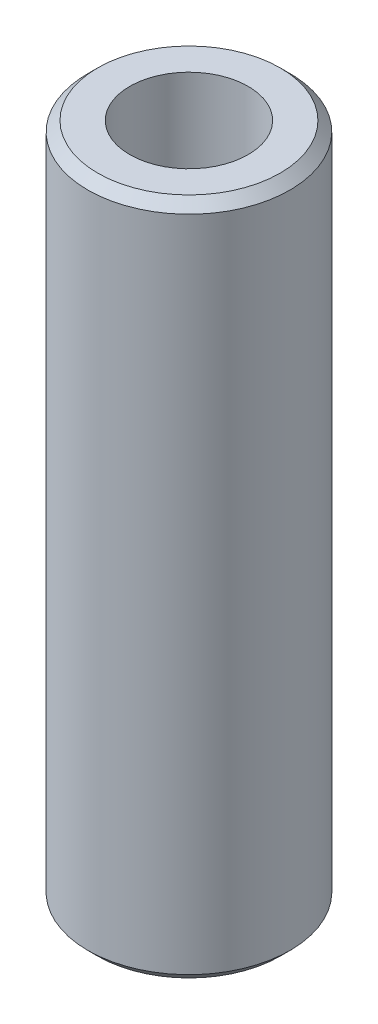
ISO-10303-21;
HEADER;
FILE_DESCRIPTION(('STEP AP214'),'2;1');
FILE_NAME('part.step','',(''),(''),'','','');
FILE_SCHEMA(('AUTOMOTIVE_DESIGN { 1 0 10303 214 1 1 1 1 }'));
ENDSEC;
DATA;
#1=APPLICATION_CONTEXT('core data for automotive mechanical design processes');
#2=APPLICATION_PROTOCOL_DEFINITION('international standard','automotive_design',2000,#1);
#3=PRODUCT_CONTEXT('',#1,'mechanical');
#4=PRODUCT('Part','Part','',(#3));
#5=PRODUCT_RELATED_PRODUCT_CATEGORY('part','',(#4));
#6=PRODUCT_DEFINITION_FORMATION('','',#4);
#7=PRODUCT_DEFINITION_CONTEXT('part definition',#1,'design');
#8=PRODUCT_DEFINITION('design','',#6,#7);
#9=PRODUCT_DEFINITION_SHAPE('','',#8);
#10=(LENGTH_UNIT() NAMED_UNIT(*) SI_UNIT(.MILLI.,.METRE.));
#11=(NAMED_UNIT(*) PLANE_ANGLE_UNIT() SI_UNIT($,.RADIAN.));
#12=(NAMED_UNIT(*) SI_UNIT($,.STERADIAN.) SOLID_ANGLE_UNIT());
#13=UNCERTAINTY_MEASURE_WITH_UNIT(LENGTH_MEASURE(1.E-05),#10,'distance_accuracy_value','');
#14=(GEOMETRIC_REPRESENTATION_CONTEXT(3) GLOBAL_UNCERTAINTY_ASSIGNED_CONTEXT((#13)) GLOBAL_UNIT_ASSIGNED_CONTEXT((#10,
#11,#12)) REPRESENTATION_CONTEXT('',''));
#15=CARTESIAN_POINT('',(0.,0.,0.));
#16=DIRECTION('',(0.,0.,1.));
#17=DIRECTION('',(1.,0.,0.));
#18=AXIS2_PLACEMENT_3D('',#15,#16,#17);
#19=CARTESIAN_POINT('',(0.,151.049852421237,0.));
#20=DIRECTION('',(0.,-1.,0.));
#21=DIRECTION('',(0.,0.,-1.));
#22=AXIS2_PLACEMENT_3D('',#19,#20,#21);
#23=CYLINDRICAL_SURFACE('',#22,22.5);
#24=CARTESIAN_POINT('',(0.,148.870045899096,0.));
#25=DIRECTION('',(0.,1.,0.));
#26=DIRECTION('',(0.,0.,1.));
#27=AXIS2_PLACEMENT_3D('',#24,#25,#26);
#28=CIRCLE('',#27,22.5);
#29=CARTESIAN_POINT('',(0.,148.870045899096,22.5));
#30=VERTEX_POINT('',#29);
#31=EDGE_CURVE('E50',#30,#30,#28,.F.);
#32=ORIENTED_EDGE('',*,*,#31,.T.);
#33=EDGE_LOOP('',(#32));
#34=FACE_BOUND('',#33,.T.);
#35=CARTESIAN_POINT('',(0.,2.17980652214148,0.));
#36=DIRECTION('',(0.,1.,0.));
#37=DIRECTION('',(0.,0.,1.));
#38=AXIS2_PLACEMENT_3D('',#35,#36,#37);
#39=CIRCLE('',#38,22.5);
#40=CARTESIAN_POINT('',(0.,2.17980652214148,22.5));
#41=VERTEX_POINT('',#40);
#42=EDGE_CURVE('E51',#41,#41,#39,.T.);
#43=ORIENTED_EDGE('',*,*,#42,.T.);
#44=EDGE_LOOP('',(#43));
#45=FACE_BOUND('',#44,.T.);
#46=ADVANCED_FACE('F39',(#34,#45),#23,.T.);
#47=CARTESIAN_POINT('',(0.,151.049852421237,0.));
#48=DIRECTION('',(0.,1.,0.));
#49=DIRECTION('',(0.,0.,1.));
#50=AXIS2_PLACEMENT_3D('',#47,#48,#49);
#51=PLANE('',#50);
#52=CARTESIAN_POINT('',(0.,151.049852421237,0.));
#53=DIRECTION('',(0.,1.,0.));
#54=DIRECTION('',(0.,0.,1.));
#55=AXIS2_PLACEMENT_3D('',#52,#53,#54);
#56=CIRCLE('',#55,20.3201934778586);
#57=CARTESIAN_POINT('',(0.,151.049852421237,20.3201934778586));
#58=VERTEX_POINT('',#57);
#59=EDGE_CURVE('E54',#58,#58,#56,.T.);
#60=ORIENTED_EDGE('',*,*,#59,.T.);
#61=EDGE_LOOP('',(#60));
#62=FACE_BOUND('',#61,.T.);
#63=CARTESIAN_POINT('',(0.,151.049852421237,0.));
#64=DIRECTION('',(0.,1.,0.));
#65=DIRECTION('',(0.,0.,1.));
#66=AXIS2_PLACEMENT_3D('',#63,#64,#65);
#67=CIRCLE('',#66,13.1851132982193);
#68=CARTESIAN_POINT('',(0.,151.049852421237,13.1851132982193));
#69=VERTEX_POINT('',#68);
#70=EDGE_CURVE('E58',#69,#69,#67,.T.);
#71=ORIENTED_EDGE('',*,*,#70,.F.);
#72=EDGE_LOOP('',(#71));
#73=FACE_BOUND('',#72,.T.);
#74=ADVANCED_FACE('F69',(#62,#73),#51,.T.);
#75=CARTESIAN_POINT('',(0.,0.,0.));
#76=DIRECTION('',(0.,1.,0.));
#77=DIRECTION('',(0.,0.,1.));
#78=AXIS2_PLACEMENT_3D('',#75,#76,#77);
#79=PLANE('',#78);
#80=CARTESIAN_POINT('',(0.,0.,0.));
#81=DIRECTION('',(0.,1.,0.));
#82=DIRECTION('',(0.,0.,1.));
#83=AXIS2_PLACEMENT_3D('',#80,#81,#82);
#84=CIRCLE('',#83,20.3201934778585);
#85=CARTESIAN_POINT('',(0.,0.,20.3201934778585));
#86=VERTEX_POINT('',#85);
#87=EDGE_CURVE('E10',#86,#86,#84,.F.);
#88=ORIENTED_EDGE('',*,*,#87,.T.);
#89=EDGE_LOOP('',(#88));
#90=FACE_BOUND('',#89,.T.);
#91=CARTESIAN_POINT('',(0.,0.,0.));
#92=DIRECTION('',(0.,1.,0.));
#93=DIRECTION('',(0.,0.,1.));
#94=AXIS2_PLACEMENT_3D('',#91,#92,#93);
#95=CIRCLE('',#94,13.1851132982193);
#96=CARTESIAN_POINT('',(0.,0.,13.1851132982193));
#97=VERTEX_POINT('',#96);
#98=EDGE_CURVE('E63',#97,#97,#95,.T.);
#99=ORIENTED_EDGE('',*,*,#98,.T.);
#100=EDGE_LOOP('',(#99));
#101=FACE_BOUND('',#100,.T.);
#102=ADVANCED_FACE('F75',(#90,#101),#79,.F.);
#103=CARTESIAN_POINT('',(0.,151.049852421237,0.));
#104=DIRECTION('',(0.,-1.,0.));
#105=DIRECTION('',(0.,0.,-1.));
#106=AXIS2_PLACEMENT_3D('',#103,#104,#105);
#107=CYLINDRICAL_SURFACE('',#106,13.1851132982193);
#108=ORIENTED_EDGE('',*,*,#70,.T.);
#109=EDGE_LOOP('',(#108));
#110=FACE_BOUND('',#109,.T.);
#111=ORIENTED_EDGE('',*,*,#98,.F.);
#112=EDGE_LOOP('',(#111));
#113=FACE_BOUND('',#112,.T.);
#114=ADVANCED_FACE('F70',(#110,#113),#107,.F.);
#115=CARTESIAN_POINT('',(0.,151.049852421237,0.));
#116=DIRECTION('',(0.,-1.,0.));
#117=DIRECTION('',(0.,0.,-1.));
#118=AXIS2_PLACEMENT_3D('',#115,#116,#117);
#119=CONICAL_SURFACE('',#118,20.3201934778586,0.785398163397448);
#120=ORIENTED_EDGE('',*,*,#31,.F.);
#121=EDGE_LOOP('',(#120));
#122=FACE_BOUND('',#121,.T.);
#123=ORIENTED_EDGE('',*,*,#59,.F.);
#124=EDGE_LOOP('',(#123));
#125=FACE_BOUND('',#124,.T.);
#126=ADVANCED_FACE('F81',(#122,#125),#119,.T.);
#127=CARTESIAN_POINT('',(0.,2.17980652214148,0.));
#128=DIRECTION('',(0.,1.,0.));
#129=DIRECTION('',(0.,0.,1.));
#130=AXIS2_PLACEMENT_3D('',#127,#128,#129);
#131=CONICAL_SURFACE('',#130,22.5,0.785398163397451);
#132=ORIENTED_EDGE('',*,*,#87,.F.);
#133=EDGE_LOOP('',(#132));
#134=FACE_BOUND('',#133,.T.);
#135=ORIENTED_EDGE('',*,*,#42,.F.);
#136=EDGE_LOOP('',(#135));
#137=FACE_BOUND('',#136,.T.);
#138=ADVANCED_FACE('F45',(#134,#137),#131,.T.);
#139=CLOSED_SHELL('',(#46,#74,#102,#114,#126,#138));
#140=MANIFOLD_SOLID_BREP('B2',#139);
#141=ADVANCED_BREP_SHAPE_REPRESENTATION('',(#18,#140),#14);
#142=SHAPE_DEFINITION_REPRESENTATION(#9,#141);
ENDSEC;
END-ISO-10303-21;
